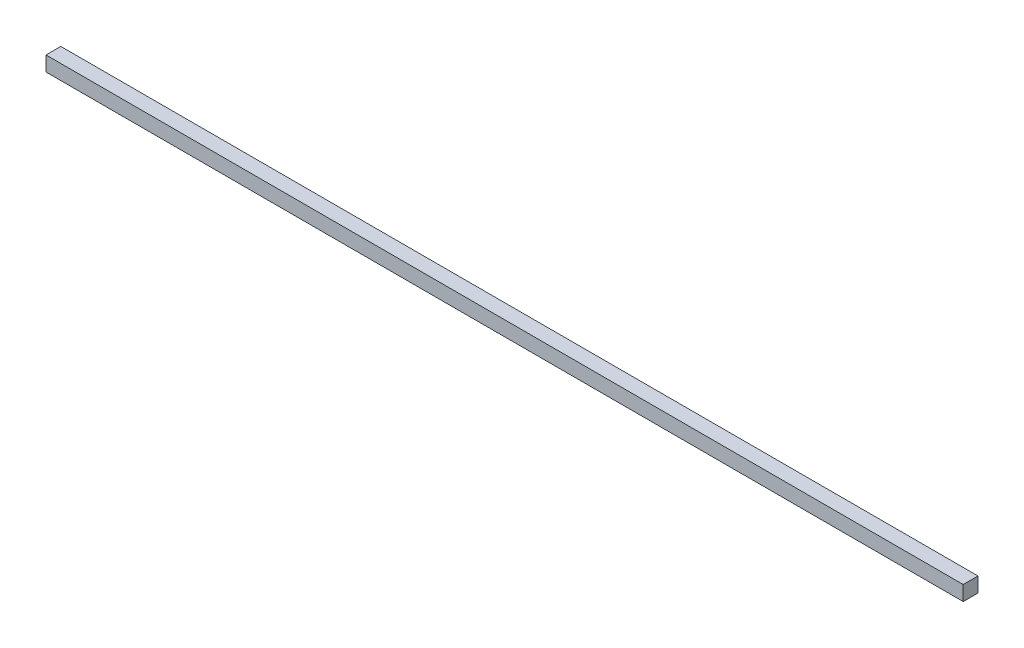
ISO-10303-21;
HEADER;
FILE_DESCRIPTION(('STEP AP214'),'2;1');
FILE_NAME('part.step','',(''),(''),'','','');
FILE_SCHEMA(('AUTOMOTIVE_DESIGN { 1 0 10303 214 1 1 1 1 }'));
ENDSEC;
DATA;
#1=APPLICATION_CONTEXT('core data for automotive mechanical design processes');
#2=APPLICATION_PROTOCOL_DEFINITION('international standard','automotive_design',2000,#1);
#3=PRODUCT_CONTEXT('',#1,'mechanical');
#4=PRODUCT('Part','Part','',(#3));
#5=PRODUCT_RELATED_PRODUCT_CATEGORY('part','',(#4));
#6=PRODUCT_DEFINITION_FORMATION('','',#4);
#7=PRODUCT_DEFINITION_CONTEXT('part definition',#1,'design');
#8=PRODUCT_DEFINITION('design','',#6,#7);
#9=PRODUCT_DEFINITION_SHAPE('','',#8);
#10=(LENGTH_UNIT() NAMED_UNIT(*) SI_UNIT(.MILLI.,.METRE.));
#11=(NAMED_UNIT(*) PLANE_ANGLE_UNIT() SI_UNIT($,.RADIAN.));
#12=(NAMED_UNIT(*) SI_UNIT($,.STERADIAN.) SOLID_ANGLE_UNIT());
#13=UNCERTAINTY_MEASURE_WITH_UNIT(LENGTH_MEASURE(1.E-05),#10,'distance_accuracy_value','');
#14=(GEOMETRIC_REPRESENTATION_CONTEXT(3) GLOBAL_UNCERTAINTY_ASSIGNED_CONTEXT((#13)) GLOBAL_UNIT_ASSIGNED_CONTEXT((#10,
#11,#12)) REPRESENTATION_CONTEXT('',''));
#15=CARTESIAN_POINT('',(0.,0.,0.));
#16=DIRECTION('',(0.,0.,1.));
#17=DIRECTION('',(1.,0.,0.));
#18=AXIS2_PLACEMENT_3D('',#15,#16,#17);
#19=CARTESIAN_POINT('',(-72.2995759050271,3.,-81.0914671849803));
#20=DIRECTION('',(1.,0.,0.));
#21=DIRECTION('',(0.,0.,-1.));
#22=AXIS2_PLACEMENT_3D('',#19,#20,#21);
#23=PLANE('',#22);
#24=DIRECTION('',(0.,0.,1.));
#25=VECTOR('',#24,1.);
#26=CARTESIAN_POINT('',(-72.2995759050271,0.,-81.0914671849803));
#27=LINE('',#26,#25);
#28=CARTESIAN_POINT('',(-72.2995759050271,0.,-84.0914671849803));
#29=VERTEX_POINT('',#28);
#30=CARTESIAN_POINT('',(-72.2995759050271,0.,-81.0914671849803));
#31=VERTEX_POINT('',#30);
#32=EDGE_CURVE('E96',#29,#31,#27,.T.);
#33=ORIENTED_EDGE('',*,*,#32,.T.);
#34=DIRECTION('',(0.,-1.,0.));
#35=VECTOR('',#34,1.);
#36=CARTESIAN_POINT('',(-72.2995759050271,3.,-81.0914671849803));
#37=LINE('',#36,#35);
#38=CARTESIAN_POINT('',(-72.2995759050271,3.,-81.0914671849803));
#39=VERTEX_POINT('',#38);
#40=EDGE_CURVE('E11',#39,#31,#37,.T.);
#41=ORIENTED_EDGE('',*,*,#40,.F.);
#42=DIRECTION('',(0.,0.,1.));
#43=VECTOR('',#42,1.);
#44=CARTESIAN_POINT('',(-72.2995759050271,3.,-81.0914671849803));
#45=LINE('',#44,#43);
#46=CARTESIAN_POINT('',(-72.2995759050271,3.,-84.0914671849803));
#47=VERTEX_POINT('',#46);
#48=EDGE_CURVE('E84',#47,#39,#45,.T.);
#49=ORIENTED_EDGE('',*,*,#48,.F.);
#50=DIRECTION('',(0.,-1.,0.));
#51=VECTOR('',#50,1.);
#52=CARTESIAN_POINT('',(-72.2995759050271,3.,-84.0914671849803));
#53=LINE('',#52,#51);
#54=EDGE_CURVE('E92',#47,#29,#53,.T.);
#55=ORIENTED_EDGE('',*,*,#54,.T.);
#56=EDGE_LOOP('',(#33,#41,#49,#55));
#57=FACE_BOUND('',#56,.T.);
#58=ADVANCED_FACE('F33',(#57),#23,.F.);
#59=CARTESIAN_POINT('',(-72.2995759050271,3.,-81.0914671849803));
#60=DIRECTION('',(0.,0.,-1.));
#61=DIRECTION('',(-1.,0.,0.));
#62=AXIS2_PLACEMENT_3D('',#59,#60,#61);
#63=PLANE('',#62);
#64=DIRECTION('',(1.,0.,0.));
#65=VECTOR('',#64,1.);
#66=CARTESIAN_POINT('',(-72.2995759050271,0.,-81.0914671849803));
#67=LINE('',#66,#65);
#68=CARTESIAN_POINT('',(113.700424094973,0.,-81.0914671849803));
#69=VERTEX_POINT('',#68);
#70=EDGE_CURVE('E88',#31,#69,#67,.T.);
#71=ORIENTED_EDGE('',*,*,#70,.T.);
#72=DIRECTION('',(0.,-1.,0.));
#73=VECTOR('',#72,1.);
#74=CARTESIAN_POINT('',(113.700424094973,3.,-81.0914671849803));
#75=LINE('',#74,#73);
#76=CARTESIAN_POINT('',(113.700424094973,3.,-81.0914671849803));
#77=VERTEX_POINT('',#76);
#78=EDGE_CURVE('E41',#77,#69,#75,.T.);
#79=ORIENTED_EDGE('',*,*,#78,.F.);
#80=DIRECTION('',(1.,0.,0.));
#81=VECTOR('',#80,1.);
#82=CARTESIAN_POINT('',(-72.2995759050271,3.,-81.0914671849803));
#83=LINE('',#82,#81);
#84=EDGE_CURVE('E79',#39,#77,#83,.T.);
#85=ORIENTED_EDGE('',*,*,#84,.F.);
#86=ORIENTED_EDGE('',*,*,#40,.T.);
#87=EDGE_LOOP('',(#71,#79,#85,#86));
#88=FACE_BOUND('',#87,.T.);
#89=ADVANCED_FACE('F87',(#88),#63,.F.);
#90=CARTESIAN_POINT('',(113.700424094973,3.,-81.0914671849803));
#91=DIRECTION('',(-1.,0.,0.));
#92=DIRECTION('',(0.,0.,1.));
#93=AXIS2_PLACEMENT_3D('',#90,#91,#92);
#94=PLANE('',#93);
#95=DIRECTION('',(0.,0.,-1.));
#96=VECTOR('',#95,1.);
#97=CARTESIAN_POINT('',(113.700424094973,0.,-81.0914671849803));
#98=LINE('',#97,#96);
#99=CARTESIAN_POINT('',(113.700424094973,0.,-84.0914671849803));
#100=VERTEX_POINT('',#99);
#101=EDGE_CURVE('E66',#69,#100,#98,.T.);
#102=ORIENTED_EDGE('',*,*,#101,.T.);
#103=DIRECTION('',(0.,-1.,0.));
#104=VECTOR('',#103,1.);
#105=CARTESIAN_POINT('',(113.700424094973,3.,-84.0914671849803));
#106=LINE('',#105,#104);
#107=CARTESIAN_POINT('',(113.700424094973,3.,-84.0914671849803));
#108=VERTEX_POINT('',#107);
#109=EDGE_CURVE('E89',#108,#100,#106,.T.);
#110=ORIENTED_EDGE('',*,*,#109,.F.);
#111=DIRECTION('',(0.,0.,-1.));
#112=VECTOR('',#111,1.);
#113=CARTESIAN_POINT('',(113.700424094973,3.,-81.0914671849803));
#114=LINE('',#113,#112);
#115=EDGE_CURVE('E82',#77,#108,#114,.T.);
#116=ORIENTED_EDGE('',*,*,#115,.F.);
#117=ORIENTED_EDGE('',*,*,#78,.T.);
#118=EDGE_LOOP('',(#102,#110,#116,#117));
#119=FACE_BOUND('',#118,.T.);
#120=ADVANCED_FACE('F90',(#119),#94,.F.);
#121=CARTESIAN_POINT('',(-72.2995759050271,3.,-84.0914671849803));
#122=DIRECTION('',(0.,0.,1.));
#123=DIRECTION('',(1.,0.,0.));
#124=AXIS2_PLACEMENT_3D('',#121,#122,#123);
#125=PLANE('',#124);
#126=DIRECTION('',(-1.,0.,0.));
#127=VECTOR('',#126,1.);
#128=CARTESIAN_POINT('',(-72.2995759050271,0.,-84.0914671849803));
#129=LINE('',#128,#127);
#130=EDGE_CURVE('E72',#100,#29,#129,.T.);
#131=ORIENTED_EDGE('',*,*,#130,.T.);
#132=ORIENTED_EDGE('',*,*,#54,.F.);
#133=DIRECTION('',(-1.,0.,0.));
#134=VECTOR('',#133,1.);
#135=CARTESIAN_POINT('',(-72.2995759050271,3.,-84.0914671849803));
#136=LINE('',#135,#134);
#137=EDGE_CURVE('E49',#108,#47,#136,.T.);
#138=ORIENTED_EDGE('',*,*,#137,.F.);
#139=ORIENTED_EDGE('',*,*,#109,.T.);
#140=EDGE_LOOP('',(#131,#132,#138,#139));
#141=FACE_BOUND('',#140,.T.);
#142=ADVANCED_FACE('F103',(#141),#125,.F.);
#143=CARTESIAN_POINT('',(0.,3.,0.));
#144=DIRECTION('',(0.,-1.,0.));
#145=DIRECTION('',(0.,0.,-1.));
#146=AXIS2_PLACEMENT_3D('',#143,#144,#145);
#147=PLANE('',#146);
#148=ORIENTED_EDGE('',*,*,#48,.T.);
#149=ORIENTED_EDGE('',*,*,#84,.T.);
#150=ORIENTED_EDGE('',*,*,#115,.T.);
#151=ORIENTED_EDGE('',*,*,#137,.T.);
#152=EDGE_LOOP('',(#148,#149,#150,#151));
#153=FACE_BOUND('',#152,.T.);
#154=ADVANCED_FACE('F80',(#153),#147,.F.);
#155=CARTESIAN_POINT('',(0.,0.,0.));
#156=DIRECTION('',(0.,-1.,0.));
#157=DIRECTION('',(0.,0.,-1.));
#158=AXIS2_PLACEMENT_3D('',#155,#156,#157);
#159=PLANE('',#158);
#160=ORIENTED_EDGE('',*,*,#32,.F.);
#161=ORIENTED_EDGE('',*,*,#130,.F.);
#162=ORIENTED_EDGE('',*,*,#101,.F.);
#163=ORIENTED_EDGE('',*,*,#70,.F.);
#164=EDGE_LOOP('',(#160,#161,#162,#163));
#165=FACE_BOUND('',#164,.T.);
#166=ADVANCED_FACE('F106',(#165),#159,.T.);
#167=CLOSED_SHELL('',(#58,#89,#120,#142,#154,#166));
#168=MANIFOLD_SOLID_BREP('B2',#167);
#169=ADVANCED_BREP_SHAPE_REPRESENTATION('',(#18,#168),#14);
#170=SHAPE_DEFINITION_REPRESENTATION(#9,#169);
ENDSEC;
END-ISO-10303-21;
